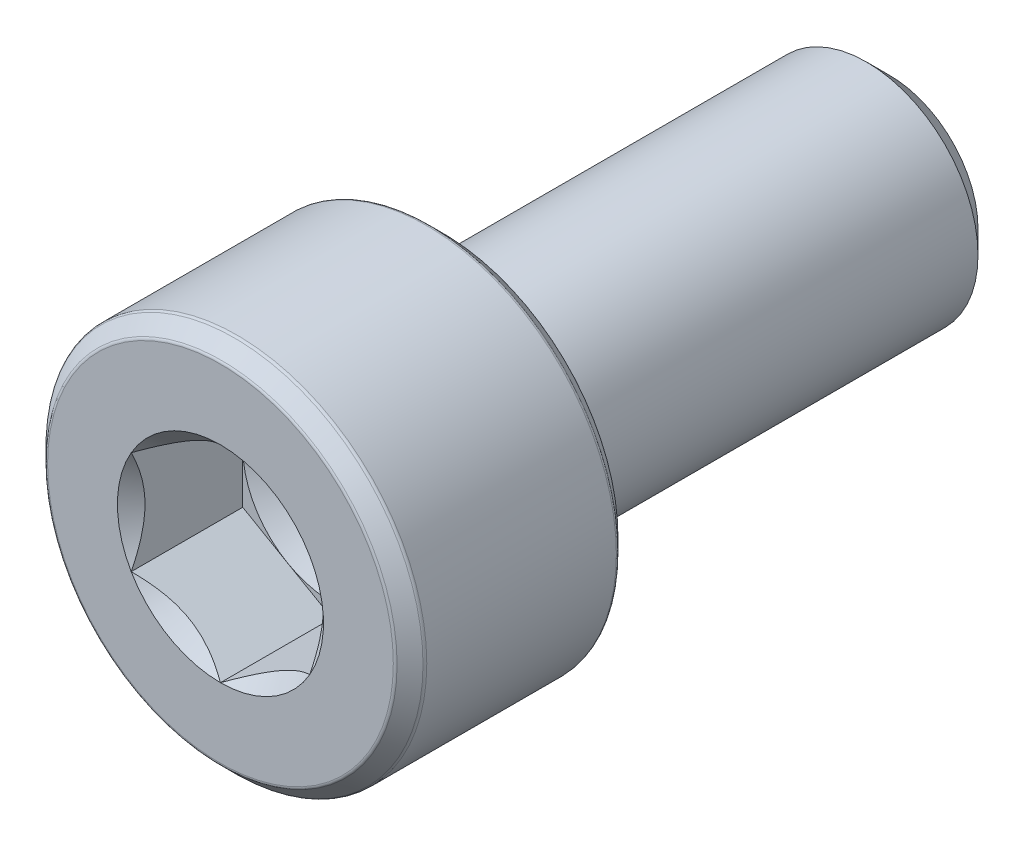
ISO-10303-21;
HEADER;
FILE_DESCRIPTION(('STEP AP214'),'2;1');
FILE_NAME('part.step','',(''),(''),'','','');
FILE_SCHEMA(('AUTOMOTIVE_DESIGN { 1 0 10303 214 1 1 1 1 }'));
ENDSEC;
DATA;
#1=APPLICATION_CONTEXT('core data for automotive mechanical design processes');
#2=APPLICATION_PROTOCOL_DEFINITION('international standard','automotive_design',2000,#1);
#3=PRODUCT_CONTEXT('',#1,'mechanical');
#4=PRODUCT('Part','Part','',(#3));
#5=PRODUCT_RELATED_PRODUCT_CATEGORY('part','',(#4));
#6=PRODUCT_DEFINITION_FORMATION('','',#4);
#7=PRODUCT_DEFINITION_CONTEXT('part definition',#1,'design');
#8=PRODUCT_DEFINITION('design','',#6,#7);
#9=PRODUCT_DEFINITION_SHAPE('','',#8);
#10=(LENGTH_UNIT() NAMED_UNIT(*) SI_UNIT(.MILLI.,.METRE.));
#11=(NAMED_UNIT(*) PLANE_ANGLE_UNIT() SI_UNIT($,.RADIAN.));
#12=(NAMED_UNIT(*) SI_UNIT($,.STERADIAN.) SOLID_ANGLE_UNIT());
#13=UNCERTAINTY_MEASURE_WITH_UNIT(LENGTH_MEASURE(1.E-05),#10,'distance_accuracy_value','');
#14=(GEOMETRIC_REPRESENTATION_CONTEXT(3) GLOBAL_UNCERTAINTY_ASSIGNED_CONTEXT((#13)) GLOBAL_UNIT_ASSIGNED_CONTEXT((#10,
#11,#12)) REPRESENTATION_CONTEXT('',''));
#15=CARTESIAN_POINT('',(0.,0.,0.));
#16=DIRECTION('',(0.,0.,1.));
#17=DIRECTION('',(1.,0.,0.));
#18=AXIS2_PLACEMENT_3D('',#15,#16,#17);
#19=CARTESIAN_POINT('',(0.,2.,5.));
#20=DIRECTION('',(0.,0.,-1.));
#21=DIRECTION('',(-1.,0.,0.));
#22=AXIS2_PLACEMENT_3D('',#19,#20,#21);
#23=PLANE('',#22);
#24=DIRECTION('',(0.,-1.,0.));
#25=VECTOR('',#24,1.);
#26=CARTESIAN_POINT('',(-2.,1.15470053837925,5.));
#27=LINE('',#26,#25);
#28=CARTESIAN_POINT('',(-2.,1.15470053837925,5.));
#29=VERTEX_POINT('',#28);
#30=CARTESIAN_POINT('',(-2.,0.,5.));
#31=VERTEX_POINT('',#30);
#32=EDGE_CURVE('E142',#29,#31,#27,.T.);
#33=ORIENTED_EDGE('',*,*,#32,.T.);
#34=CARTESIAN_POINT('',(0.,0.,5.));
#35=DIRECTION('',(0.,0.,-1.));
#36=DIRECTION('',(-1.,0.,0.));
#37=AXIS2_PLACEMENT_3D('',#34,#35,#36);
#38=CIRCLE('',#37,2.);
#39=CARTESIAN_POINT('',(-1.,1.73205080756888,5.));
#40=VERTEX_POINT('',#39);
#41=EDGE_CURVE('E11',#31,#40,#38,.T.);
#42=ORIENTED_EDGE('',*,*,#41,.T.);
#43=DIRECTION('',(-0.866025403784439,-0.5,0.));
#44=VECTOR('',#43,1.);
#45=CARTESIAN_POINT('',(0.,2.3094010767585,5.));
#46=LINE('',#45,#44);
#47=EDGE_CURVE('E135',#40,#29,#46,.T.);
#48=ORIENTED_EDGE('',*,*,#47,.T.);
#49=EDGE_LOOP('',(#33,#42,#48));
#50=FACE_BOUND('',#49,.T.);
#51=ADVANCED_FACE('F33',(#50),#23,.F.);
#52=CARTESIAN_POINT('',(0.,2.3094010767585,5.));
#53=VERTEX_POINT('',#52);
#54=EDGE_CURVE('E122',#53,#40,#46,.T.);
#55=ORIENTED_EDGE('',*,*,#54,.T.);
#56=CARTESIAN_POINT('',(0.999999999999999,1.73205080756888,5.));
#57=VERTEX_POINT('',#56);
#58=EDGE_CURVE('E42',#40,#57,#38,.T.);
#59=ORIENTED_EDGE('',*,*,#58,.T.);
#60=DIRECTION('',(-0.866025403784439,0.5,0.));
#61=VECTOR('',#60,1.);
#62=CARTESIAN_POINT('',(2.,1.15470053837925,5.));
#63=LINE('',#62,#61);
#64=EDGE_CURVE('E120',#57,#53,#63,.T.);
#65=ORIENTED_EDGE('',*,*,#64,.T.);
#66=EDGE_LOOP('',(#55,#59,#65));
#67=FACE_BOUND('',#66,.T.);
#68=ADVANCED_FACE('F119',(#67),#23,.F.);
#69=CARTESIAN_POINT('',(2.,1.15470053837925,5.));
#70=VERTEX_POINT('',#69);
#71=EDGE_CURVE('E127',#70,#57,#63,.T.);
#72=ORIENTED_EDGE('',*,*,#71,.T.);
#73=CARTESIAN_POINT('',(0.,0.,5.));
#74=DIRECTION('',(0.,0.,1.));
#75=DIRECTION('',(1.,0.,0.));
#76=AXIS2_PLACEMENT_3D('',#73,#74,#75);
#77=CIRCLE('',#76,2.);
#78=CARTESIAN_POINT('',(2.,0.,5.));
#79=VERTEX_POINT('',#78);
#80=EDGE_CURVE('E110',#79,#57,#77,.T.);
#81=ORIENTED_EDGE('',*,*,#80,.F.);
#82=DIRECTION('',(0.,1.,0.));
#83=VECTOR('',#82,1.);
#84=CARTESIAN_POINT('',(2.,-1.15470053837925,5.));
#85=LINE('',#84,#83);
#86=EDGE_CURVE('E55',#79,#70,#85,.T.);
#87=ORIENTED_EDGE('',*,*,#86,.T.);
#88=EDGE_LOOP('',(#72,#81,#87));
#89=FACE_BOUND('',#88,.T.);
#90=ADVANCED_FACE('F134',(#89),#23,.F.);
#91=CARTESIAN_POINT('',(2.,-1.15470053837925,5.));
#92=VERTEX_POINT('',#91);
#93=EDGE_CURVE('E153',#92,#79,#85,.T.);
#94=ORIENTED_EDGE('',*,*,#93,.T.);
#95=CARTESIAN_POINT('',(0.999999999999999,-1.73205080756887,5.));
#96=VERTEX_POINT('',#95);
#97=EDGE_CURVE('E113',#79,#96,#38,.T.);
#98=ORIENTED_EDGE('',*,*,#97,.T.);
#99=DIRECTION('',(0.866025403784439,0.5,0.));
#100=VECTOR('',#99,1.);
#101=CARTESIAN_POINT('',(0.,-2.3094010767585,5.));
#102=LINE('',#101,#100);
#103=EDGE_CURVE('E149',#96,#92,#102,.T.);
#104=ORIENTED_EDGE('',*,*,#103,.T.);
#105=EDGE_LOOP('',(#94,#98,#104));
#106=FACE_BOUND('',#105,.T.);
#107=ADVANCED_FACE('F212',(#106),#23,.F.);
#108=CARTESIAN_POINT('',(0.,-2.3094010767585,5.));
#109=VERTEX_POINT('',#108);
#110=EDGE_CURVE('E150',#109,#96,#102,.T.);
#111=ORIENTED_EDGE('',*,*,#110,.T.);
#112=CARTESIAN_POINT('',(-1.,-1.73205080756887,5.));
#113=VERTEX_POINT('',#112);
#114=EDGE_CURVE('E204',#96,#113,#38,.T.);
#115=ORIENTED_EDGE('',*,*,#114,.T.);
#116=DIRECTION('',(0.866025403784439,-0.5,0.));
#117=VECTOR('',#116,1.);
#118=CARTESIAN_POINT('',(-2.,-1.15470053837925,5.));
#119=LINE('',#118,#117);
#120=EDGE_CURVE('E145',#113,#109,#119,.T.);
#121=ORIENTED_EDGE('',*,*,#120,.T.);
#122=EDGE_LOOP('',(#111,#115,#121));
#123=FACE_BOUND('',#122,.T.);
#124=ADVANCED_FACE('F220',(#123),#23,.F.);
#125=CARTESIAN_POINT('',(0.,3.87479184719829,7.5));
#126=DIRECTION('',(0.,0.,-1.));
#127=DIRECTION('',(-1.,0.,0.));
#128=AXIS2_PLACEMENT_3D('',#125,#126,#127);
#129=PLANE('',#128);
#130=CARTESIAN_POINT('',(0.,0.,7.5));
#131=DIRECTION('',(0.,0.,1.));
#132=DIRECTION('',(1.,0.,0.));
#133=AXIS2_PLACEMENT_3D('',#130,#131,#132);
#134=CIRCLE('',#133,2.3094010767585);
#135=CARTESIAN_POINT('',(0.,2.3094010767585,7.5));
#136=VERTEX_POINT('',#135);
#137=CARTESIAN_POINT('',(-2.,1.15470053837925,7.5));
#138=VERTEX_POINT('',#137);
#139=EDGE_CURVE('E251',#136,#138,#134,.T.);
#140=ORIENTED_EDGE('',*,*,#139,.F.);
#141=CARTESIAN_POINT('',(0.,0.,7.5));
#142=DIRECTION('',(0.,0.,1.));
#143=DIRECTION('',(1.,0.,0.));
#144=AXIS2_PLACEMENT_3D('',#141,#142,#143);
#145=CIRCLE('',#144,2.3094010767585);
#146=CARTESIAN_POINT('',(2.,1.15470053837925,7.5));
#147=VERTEX_POINT('',#146);
#148=EDGE_CURVE('E114',#147,#136,#145,.T.);
#149=ORIENTED_EDGE('',*,*,#148,.F.);
#150=CARTESIAN_POINT('',(0.,0.,7.5));
#151=DIRECTION('',(0.,0.,1.));
#152=DIRECTION('',(1.,0.,0.));
#153=AXIS2_PLACEMENT_3D('',#150,#151,#152);
#154=CIRCLE('',#153,2.3094010767585);
#155=CARTESIAN_POINT('',(2.,-1.15470053837925,7.5));
#156=VERTEX_POINT('',#155);
#157=EDGE_CURVE('E132',#156,#147,#154,.T.);
#158=ORIENTED_EDGE('',*,*,#157,.F.);
#159=CARTESIAN_POINT('',(0.,0.,7.5));
#160=DIRECTION('',(0.,0.,1.));
#161=DIRECTION('',(1.,0.,0.));
#162=AXIS2_PLACEMENT_3D('',#159,#160,#161);
#163=CIRCLE('',#162,2.3094010767585);
#164=CARTESIAN_POINT('',(0.,-2.3094010767585,7.5));
#165=VERTEX_POINT('',#164);
#166=EDGE_CURVE('E257',#165,#156,#163,.T.);
#167=ORIENTED_EDGE('',*,*,#166,.F.);
#168=CARTESIAN_POINT('',(0.,0.,7.5));
#169=DIRECTION('',(0.,0.,1.));
#170=DIRECTION('',(1.,0.,0.));
#171=AXIS2_PLACEMENT_3D('',#168,#169,#170);
#172=CIRCLE('',#171,2.3094010767585);
#173=CARTESIAN_POINT('',(-2.,-1.15470053837925,7.5));
#174=VERTEX_POINT('',#173);
#175=EDGE_CURVE('E138',#174,#165,#172,.T.);
#176=ORIENTED_EDGE('',*,*,#175,.F.);
#177=CARTESIAN_POINT('',(0.,0.,7.5));
#178=DIRECTION('',(0.,0.,1.));
#179=DIRECTION('',(1.,0.,0.));
#180=AXIS2_PLACEMENT_3D('',#177,#178,#179);
#181=CIRCLE('',#180,2.3094010767585);
#182=EDGE_CURVE('E243',#138,#174,#181,.T.);
#183=ORIENTED_EDGE('',*,*,#182,.F.);
#184=EDGE_LOOP('',(#140,#149,#158,#167,#176,#183));
#185=FACE_BOUND('',#184,.T.);
#186=CARTESIAN_POINT('',(0.,0.,7.5));
#187=DIRECTION('',(0.,0.,1.));
#188=DIRECTION('',(1.,0.,0.));
#189=AXIS2_PLACEMENT_3D('',#186,#187,#188);
#190=CIRCLE('',#189,3.87479184719829);
#191=CARTESIAN_POINT('',(3.87479184719829,0.,7.5));
#192=VERTEX_POINT('',#191);
#193=EDGE_CURVE('E200',#192,#192,#190,.T.);
#194=ORIENTED_EDGE('',*,*,#193,.T.);
#195=EDGE_LOOP('',(#194));
#196=FACE_BOUND('',#195,.T.);
#197=ADVANCED_FACE('F35',(#185,#196),#129,.F.);
#198=CARTESIAN_POINT('',(0.,0.,7.415));
#199=DIRECTION('',(0.,0.,1.));
#200=DIRECTION('',(1.,0.,0.));
#201=AXIS2_PLACEMENT_3D('',#198,#199,#200);
#202=TOROIDAL_SURFACE('',#201,3.87479184719829,0.0850000000000001);
#203=ORIENTED_EDGE('',*,*,#193,.F.);
#204=EDGE_LOOP('',(#203));
#205=FACE_BOUND('',#204,.T.);
#206=CARTESIAN_POINT('',(0.,0.,7.47510407640085));
#207=DIRECTION('',(0.,0.,1.));
#208=DIRECTION('',(1.,0.,0.));
#209=AXIS2_PLACEMENT_3D('',#206,#207,#208);
#210=CIRCLE('',#209,3.93489592359915);
#211=CARTESIAN_POINT('',(3.93489592359915,0.,7.47510407640085));
#212=VERTEX_POINT('',#211);
#213=EDGE_CURVE('E198',#212,#212,#210,.T.);
#214=ORIENTED_EDGE('',*,*,#213,.T.);
#215=EDGE_LOOP('',(#214));
#216=FACE_BOUND('',#215,.T.);
#217=ADVANCED_FACE('F344',(#205,#216),#202,.T.);
#218=CARTESIAN_POINT('',(0.,0.,7.18489592359915));
#219=DIRECTION('',(0.,0.,-1.));
#220=DIRECTION('',(-1.,0.,0.));
#221=AXIS2_PLACEMENT_3D('',#218,#219,#220);
#222=CONICAL_SURFACE('',#221,4.22510407640086,0.785398163397453);
#223=ORIENTED_EDGE('',*,*,#213,.F.);
#224=EDGE_LOOP('',(#223));
#225=FACE_BOUND('',#224,.T.);
#226=CARTESIAN_POINT('',(0.,0.,7.18489592359915));
#227=DIRECTION('',(0.,0.,1.));
#228=DIRECTION('',(1.,0.,0.));
#229=AXIS2_PLACEMENT_3D('',#226,#227,#228);
#230=CIRCLE('',#229,4.22510407640086);
#231=CARTESIAN_POINT('',(4.22510407640086,0.,7.18489592359915));
#232=VERTEX_POINT('',#231);
#233=EDGE_CURVE('E195',#232,#232,#230,.T.);
#234=ORIENTED_EDGE('',*,*,#233,.T.);
#235=EDGE_LOOP('',(#234));
#236=FACE_BOUND('',#235,.T.);
#237=ADVANCED_FACE('F341',(#225,#236),#222,.T.);
#238=CARTESIAN_POINT('',(0.,0.,7.12479184719829));
#239=DIRECTION('',(0.,0.,1.));
#240=DIRECTION('',(1.,0.,0.));
#241=AXIS2_PLACEMENT_3D('',#238,#239,#240);
#242=TOROIDAL_SURFACE('',#241,4.165,0.0850000000000002);
#243=ORIENTED_EDGE('',*,*,#233,.F.);
#244=EDGE_LOOP('',(#243));
#245=FACE_BOUND('',#244,.T.);
#246=CARTESIAN_POINT('',(0.,0.,7.12479184719829));
#247=DIRECTION('',(0.,0.,1.));
#248=DIRECTION('',(1.,0.,0.));
#249=AXIS2_PLACEMENT_3D('',#246,#247,#248);
#250=CIRCLE('',#249,4.25);
#251=CARTESIAN_POINT('',(4.25,0.,7.12479184719829));
#252=VERTEX_POINT('',#251);
#253=EDGE_CURVE('E192',#252,#252,#250,.T.);
#254=ORIENTED_EDGE('',*,*,#253,.T.);
#255=EDGE_LOOP('',(#254));
#256=FACE_BOUND('',#255,.T.);
#257=ADVANCED_FACE('F337',(#245,#256),#242,.T.);
#258=CARTESIAN_POINT('',(0.,0.,7.5));
#259=DIRECTION('',(0.,0.,1.));
#260=DIRECTION('',(1.,0.,0.));
#261=AXIS2_PLACEMENT_3D('',#258,#259,#260);
#262=CYLINDRICAL_SURFACE('',#261,4.25);
#263=ORIENTED_EDGE('',*,*,#253,.F.);
#264=EDGE_LOOP('',(#263));
#265=FACE_BOUND('',#264,.T.);
#266=CARTESIAN_POINT('',(0.,0.,2.87520815280171));
#267=DIRECTION('',(0.,0.,1.));
#268=DIRECTION('',(1.,0.,0.));
#269=AXIS2_PLACEMENT_3D('',#266,#267,#268);
#270=CIRCLE('',#269,4.25);
#271=CARTESIAN_POINT('',(4.25,0.,2.87520815280171));
#272=VERTEX_POINT('',#271);
#273=EDGE_CURVE('E189',#272,#272,#270,.T.);
#274=ORIENTED_EDGE('',*,*,#273,.T.);
#275=EDGE_LOOP('',(#274));
#276=FACE_BOUND('',#275,.T.);
#277=ADVANCED_FACE('F333',(#265,#276),#262,.T.);
#278=CARTESIAN_POINT('',(0.,0.,2.87520815280171));
#279=DIRECTION('',(0.,0.,1.));
#280=DIRECTION('',(1.,0.,0.));
#281=AXIS2_PLACEMENT_3D('',#278,#279,#280);
#282=TOROIDAL_SURFACE('',#281,4.165,0.0849999999999999);
#283=ORIENTED_EDGE('',*,*,#273,.F.);
#284=EDGE_LOOP('',(#283));
#285=FACE_BOUND('',#284,.T.);
#286=CARTESIAN_POINT('',(0.,0.,2.81510407640085));
#287=DIRECTION('',(0.,0.,1.));
#288=DIRECTION('',(1.,0.,0.));
#289=AXIS2_PLACEMENT_3D('',#286,#287,#288);
#290=CIRCLE('',#289,4.22510407640086);
#291=CARTESIAN_POINT('',(4.22510407640086,0.,2.81510407640085));
#292=VERTEX_POINT('',#291);
#293=EDGE_CURVE('E186',#292,#292,#290,.T.);
#294=ORIENTED_EDGE('',*,*,#293,.T.);
#295=EDGE_LOOP('',(#294));
#296=FACE_BOUND('',#295,.T.);
#297=ADVANCED_FACE('F329',(#285,#296),#282,.T.);
#298=CARTESIAN_POINT('',(0.,0.,2.52489592359914));
#299=DIRECTION('',(0.,0.,1.));
#300=DIRECTION('',(1.,0.,0.));
#301=AXIS2_PLACEMENT_3D('',#298,#299,#300);
#302=CONICAL_SURFACE('',#301,3.93489592359915,0.785398163397447);
#303=ORIENTED_EDGE('',*,*,#293,.F.);
#304=EDGE_LOOP('',(#303));
#305=FACE_BOUND('',#304,.T.);
#306=CARTESIAN_POINT('',(0.,0.,2.52489592359914));
#307=DIRECTION('',(0.,0.,1.));
#308=DIRECTION('',(1.,0.,0.));
#309=AXIS2_PLACEMENT_3D('',#306,#307,#308);
#310=CIRCLE('',#309,3.93489592359915);
#311=CARTESIAN_POINT('',(3.93489592359915,0.,2.52489592359914));
#312=VERTEX_POINT('',#311);
#313=EDGE_CURVE('E183',#312,#312,#310,.T.);
#314=ORIENTED_EDGE('',*,*,#313,.T.);
#315=EDGE_LOOP('',(#314));
#316=FACE_BOUND('',#315,.T.);
#317=ADVANCED_FACE('F325',(#305,#316),#302,.T.);
#318=CARTESIAN_POINT('',(0.,0.,2.585));
#319=DIRECTION('',(0.,0.,1.));
#320=DIRECTION('',(1.,0.,0.));
#321=AXIS2_PLACEMENT_3D('',#318,#319,#320);
#322=TOROIDAL_SURFACE('',#321,3.87479184719829,0.0849999999999998);
#323=ORIENTED_EDGE('',*,*,#313,.F.);
#324=EDGE_LOOP('',(#323));
#325=FACE_BOUND('',#324,.T.);
#326=CARTESIAN_POINT('',(0.,0.,2.5));
#327=DIRECTION('',(0.,0.,1.));
#328=DIRECTION('',(1.,0.,0.));
#329=AXIS2_PLACEMENT_3D('',#326,#327,#328);
#330=CIRCLE('',#329,3.87479184719829);
#331=CARTESIAN_POINT('',(3.87479184719829,0.,2.5));
#332=VERTEX_POINT('',#331);
#333=EDGE_CURVE('E180',#332,#332,#330,.T.);
#334=ORIENTED_EDGE('',*,*,#333,.T.);
#335=EDGE_LOOP('',(#334));
#336=FACE_BOUND('',#335,.T.);
#337=ADVANCED_FACE('F321',(#325,#336),#322,.T.);
#338=CARTESIAN_POINT('',(0.,2.5,2.5));
#339=DIRECTION('',(0.,0.,1.));
#340=DIRECTION('',(1.,0.,0.));
#341=AXIS2_PLACEMENT_3D('',#338,#339,#340);
#342=PLANE('',#341);
#343=ORIENTED_EDGE('',*,*,#333,.F.);
#344=EDGE_LOOP('',(#343));
#345=FACE_BOUND('',#344,.T.);
#346=CARTESIAN_POINT('',(0.,0.,2.5));
#347=DIRECTION('',(0.,0.,1.));
#348=DIRECTION('',(1.,0.,0.));
#349=AXIS2_PLACEMENT_3D('',#346,#347,#348);
#350=CIRCLE('',#349,2.5);
#351=CARTESIAN_POINT('',(2.5,0.,2.5));
#352=VERTEX_POINT('',#351);
#353=EDGE_CURVE('E177',#352,#352,#350,.T.);
#354=ORIENTED_EDGE('',*,*,#353,.T.);
#355=EDGE_LOOP('',(#354));
#356=FACE_BOUND('',#355,.T.);
#357=ADVANCED_FACE('F317',(#345,#356),#342,.F.);
#358=CARTESIAN_POINT('',(0.,0.,7.5));
#359=DIRECTION('',(0.,0.,1.));
#360=DIRECTION('',(1.,0.,0.));
#361=AXIS2_PLACEMENT_3D('',#358,#359,#360);
#362=CYLINDRICAL_SURFACE('',#361,2.5);
#363=ORIENTED_EDGE('',*,*,#353,.F.);
#364=EDGE_LOOP('',(#363));
#365=FACE_BOUND('',#364,.T.);
#366=CARTESIAN_POINT('',(0.,0.,-6.98038475772934));
#367=DIRECTION('',(0.,0.,1.));
#368=DIRECTION('',(1.,0.,0.));
#369=AXIS2_PLACEMENT_3D('',#366,#367,#368);
#370=CIRCLE('',#369,2.5);
#371=CARTESIAN_POINT('',(2.5,0.,-6.98038475772934));
#372=VERTEX_POINT('',#371);
#373=EDGE_CURVE('E174',#372,#372,#370,.T.);
#374=ORIENTED_EDGE('',*,*,#373,.T.);
#375=EDGE_LOOP('',(#374));
#376=FACE_BOUND('',#375,.T.);
#377=ADVANCED_FACE('F313',(#365,#376),#362,.T.);
#378=CARTESIAN_POINT('',(0.,0.,-7.5));
#379=DIRECTION('',(0.,0.,1.));
#380=DIRECTION('',(1.,0.,0.));
#381=AXIS2_PLACEMENT_3D('',#378,#379,#380);
#382=CONICAL_SURFACE('',#381,1.98038475772933,0.78539816339745);
#383=ORIENTED_EDGE('',*,*,#373,.F.);
#384=EDGE_LOOP('',(#383));
#385=FACE_BOUND('',#384,.T.);
#386=CARTESIAN_POINT('',(0.,0.,-7.5));
#387=DIRECTION('',(0.,0.,1.));
#388=DIRECTION('',(1.,0.,0.));
#389=AXIS2_PLACEMENT_3D('',#386,#387,#388);
#390=CIRCLE('',#389,1.98038475772933);
#391=CARTESIAN_POINT('',(1.98038475772933,0.,-7.5));
#392=VERTEX_POINT('',#391);
#393=EDGE_CURVE('E158',#392,#392,#390,.T.);
#394=ORIENTED_EDGE('',*,*,#393,.T.);
#395=EDGE_LOOP('',(#394));
#396=FACE_BOUND('',#395,.T.);
#397=ADVANCED_FACE('F309',(#385,#396),#382,.T.);
#398=CARTESIAN_POINT('',(0.,0.,-7.5));
#399=DIRECTION('',(0.,0.,1.));
#400=DIRECTION('',(1.,0.,0.));
#401=AXIS2_PLACEMENT_3D('',#398,#399,#400);
#402=PLANE('',#401);
#403=ORIENTED_EDGE('',*,*,#393,.F.);
#404=EDGE_LOOP('',(#403));
#405=FACE_BOUND('',#404,.T.);
#406=ADVANCED_FACE('F304',(#405),#402,.F.);
#407=CARTESIAN_POINT('',(2.,1.15470053837925,5.));
#408=DIRECTION('',(0.5,0.866025403784439,0.));
#409=DIRECTION('',(-0.866025403784439,0.5,0.));
#410=AXIS2_PLACEMENT_3D('',#407,#408,#409);
#411=PLANE('',#410);
#412=DIRECTION('',(0.,0.,1.));
#413=VECTOR('',#412,1.);
#414=CARTESIAN_POINT('',(2.,1.15470053837925,5.));
#415=LINE('',#414,#413);
#416=EDGE_CURVE('E156',#70,#147,#415,.T.);
#417=ORIENTED_EDGE('',*,*,#416,.T.);
#418=CARTESIAN_POINT('',(-0.000199999999999977,2.30951654681234,7.50011547871366));
#419=CARTESIAN_POINT('',(0.0685530340307055,2.26982196410711,7.46045309022559));
#420=CARTESIAN_POINT('',(0.138455742135512,2.22946361676572,7.42311998228416));
#421=CARTESIAN_POINT('',(0.280995244550437,2.1471683966763,7.35476368513614));
#422=CARTESIAN_POINT('',(0.353645597565359,2.10522369580642,7.32377853373722));
#423=CARTESIAN_POINT('',(0.500141601053972,2.02064418875706,7.27070021654414));
#424=CARTESIAN_POINT('',(0.573949935246295,1.97803092714269,7.24847362717661));
#425=CARTESIAN_POINT('',(0.723191631835265,1.89186619344273,7.21422881667508));
#426=CARTESIAN_POINT('',(0.798620433918153,1.84831735425552,7.20218502914413));
#427=CARTESIAN_POINT('',(0.92861550067108,1.7732646674724,7.19131851190557));
#428=CARTESIAN_POINT('',(0.98301378397011,1.74185780396625,7.18970975360997));
#429=CARTESIAN_POINT('',(1.09172145551969,1.67909540053412,7.19241887759871));
#430=CARTESIAN_POINT('',(1.14603080592134,1.64773988246021,7.19673883775797));
#431=CARTESIAN_POINT('',(1.25413672758934,1.5853248994842,7.21105956740991));
#432=CARTESIAN_POINT('',(1.30793265655479,1.55426580541469,7.22106669276201));
#433=CARTESIAN_POINT('',(1.41459426230557,1.49268469862228,7.24621243024966));
#434=CARTESIAN_POINT('',(1.46746001007071,1.46216264491917,7.26135064904224));
#435=CARTESIAN_POINT('',(1.60287973308985,1.38397803138049,7.30629450342919));
#436=CARTESIAN_POINT('',(1.68459383484948,1.33680037273297,7.33948883942582));
#437=CARTESIAN_POINT('',(1.8047470372578,1.26742988897853,7.39552582317137));
#438=CARTESIAN_POINT('',(1.84434285210918,1.24456923461531,7.41521470294694));
#439=CARTESIAN_POINT('',(1.92280095888787,1.19927142554652,7.45638731836487));
#440=CARTESIAN_POINT('',(1.96166368359374,1.17683402097614,7.47786995165125));
#441=CARTESIAN_POINT('',(2.0002,1.15458506832541,7.50011547871366));
#442=B_SPLINE_CURVE_WITH_KNOTS('',3,(#418,#419,#420,#421,#422,#423,#424,#425,#426,#427,#428,
#429,#430,#431,#432,#433,#434,#435,#436,#437,#438,#439,#440,#441),.UNSPECIFIED.,.F.,.F.,(4,2,2,
2,2,2,2,2,2,2,2,4),(0.,0.266420613771064,0.53439375152339,0.798110374376916,1.06116288956937,
1.24939906803722,1.43770123566248,1.62621426093932,1.81471283831913,2.11415604834145,
2.2634717071779,2.41269626969771),.UNSPECIFIED.);
#443=EDGE_CURVE('E244',#136,#147,#442,.T.);
#444=ORIENTED_EDGE('',*,*,#443,.F.);
#445=DIRECTION('',(0.,0.,1.));
#446=VECTOR('',#445,1.);
#447=CARTESIAN_POINT('',(0.,2.3094010767585,5.));
#448=LINE('',#447,#446);
#449=EDGE_CURVE('E131',#53,#136,#448,.T.);
#450=ORIENTED_EDGE('',*,*,#449,.F.);
#451=ORIENTED_EDGE('',*,*,#64,.F.);
#452=ORIENTED_EDGE('',*,*,#71,.F.);
#453=EDGE_LOOP('',(#417,#444,#450,#451,#452));
#454=FACE_BOUND('',#453,.T.);
#455=ADVANCED_FACE('F126',(#454),#411,.F.);
#456=CARTESIAN_POINT('',(2.,-1.15470053837925,5.));
#457=DIRECTION('',(1.,0.,0.));
#458=DIRECTION('',(0.,1.,0.));
#459=AXIS2_PLACEMENT_3D('',#456,#457,#458);
#460=PLANE('',#459);
#461=DIRECTION('',(0.,0.,1.));
#462=VECTOR('',#461,1.);
#463=CARTESIAN_POINT('',(2.,-1.15470053837925,5.));
#464=LINE('',#463,#462);
#465=EDGE_CURVE('E159',#92,#156,#464,.T.);
#466=ORIENTED_EDGE('',*,*,#465,.T.);
#467=CARTESIAN_POINT('',(2.,-2.30294417292923,8.24077135502772));
#468=CARTESIAN_POINT('',(2.,-2.24687002663712,8.19844327362596));
#469=CARTESIAN_POINT('',(2.,-2.19048190536959,8.15652515686433));
#470=CARTESIAN_POINT('',(2.,-2.07695390496424,8.07369041786101));
#471=CARTESIAN_POINT('',(2.,-2.01981384066454,8.03277404966807));
#472=CARTESIAN_POINT('',(2.,-1.90424016804775,7.95183345201856));
#473=CARTESIAN_POINT('',(2.,-1.8457999674391,7.91181859155986));
#474=CARTESIAN_POINT('',(2.,-1.7279274546176,7.83328899366429));
#475=CARTESIAN_POINT('',(2.,-1.66849521292324,7.79477415024314));
#476=CARTESIAN_POINT('',(2.,-1.4816299571002,7.67764065160429));
#477=CARTESIAN_POINT('',(2.,-1.35220318163536,7.60214590172964));
#478=CARTESIAN_POINT('',(2.,-1.08689521592924,7.46404935099438));
#479=CARTESIAN_POINT('',(2.,-0.951037763938191,7.40140408590349));
#480=CARTESIAN_POINT('',(2.,-0.747111912259408,7.32476354387514));
#481=CARTESIAN_POINT('',(2.,-0.682064034147875,7.30276717991912));
#482=CARTESIAN_POINT('',(2.,-0.550398103294752,7.26399668766014));
#483=CARTESIAN_POINT('',(2.,-0.483779942722475,7.24722291912118));
#484=CARTESIAN_POINT('',(2.,-0.350484328847654,7.22004825788444));
#485=CARTESIAN_POINT('',(2.,-0.283829489364785,7.20953817674169));
#486=CARTESIAN_POINT('',(2.,-0.149806987139377,7.19509608554491));
#487=CARTESIAN_POINT('',(2.,-0.082439448934122,7.19116294473311));
#488=CARTESIAN_POINT('',(2.,0.0499055622944893,7.19016647693372));
#489=CARTESIAN_POINT('',(2.,0.114881285143172,7.19285964485041));
#490=CARTESIAN_POINT('',(2.,0.24427592148276,7.20443007042269));
#491=CARTESIAN_POINT('',(2.,0.308694780266753,7.21330792883322));
#492=CARTESIAN_POINT('',(2.,0.437599788610704,7.23691365929615));
#493=CARTESIAN_POINT('',(2.,0.502067428644594,7.25174108344651));
#494=CARTESIAN_POINT('',(2.,0.629594322598305,7.28645788362797));
#495=CARTESIAN_POINT('',(2.,0.692653693883149,7.30634683610627));
#496=CARTESIAN_POINT('',(2.,0.891187889210543,7.3764469792562));
#497=CARTESIAN_POINT('',(2.,1.02383545707306,7.43464180032151));
#498=CARTESIAN_POINT('',(2.,1.28290932150074,7.56403057545957));
#499=CARTESIAN_POINT('',(2.,1.4093111258757,7.63527123141484));
#500=CARTESIAN_POINT('',(2.,1.59200441438963,7.74644199187472));
#501=CARTESIAN_POINT('',(2.,1.6502754902619,7.78318219033737));
#502=CARTESIAN_POINT('',(2.,1.76581760389242,7.85821451418376));
#503=CARTESIAN_POINT('',(2.,1.82308856543104,7.89650675711804));
#504=CARTESIAN_POINT('',(2.,1.93629654762084,7.97404226408122));
#505=CARTESIAN_POINT('',(2.,1.99224062500538,8.01327527613358));
#506=CARTESIAN_POINT('',(2.,2.10336424029899,8.09277883073651));
#507=CARTESIAN_POINT('',(2.,2.15854398422468,8.13304908500059));
#508=CARTESIAN_POINT('',(2.,2.21340370692658,8.17374423814594));
#509=B_SPLINE_CURVE_WITH_KNOTS('',3,(#467,#468,#469,#470,#471,#472,#473,#474,#475,#476,#477,
#478,#479,#480,#481,#482,#483,#484,#485,#486,#487,#488,#489,#490,#491,#492,#493,#494,#495,#496,
#497,#498,#499,#500,#501,#502,#503,#504,#505,#506,#507,#508),.UNSPECIFIED.,.F.,.F.,(4,2,2,2,2,2,
2,2,2,2,2,2,2,2,2,2,2,2,2,2,4),(0.,0.210772731976891,0.421598374658589,0.634057554623487,
0.846501695870169,1.29562155455624,1.74319622821645,1.94902062110207,2.15485918928325,
2.35699582502635,2.5590977043214,2.75388435553556,2.94868993014814,3.14690093452585,
3.34509535789701,3.77838155837653,4.21325029921624,4.41989056685646,4.6265465146092,
4.83152377111289,5.03644465914084),.UNSPECIFIED.);
#510=EDGE_CURVE('E258',#147,#156,#509,.F.);
#511=ORIENTED_EDGE('',*,*,#510,.F.);
#512=ORIENTED_EDGE('',*,*,#416,.F.);
#513=ORIENTED_EDGE('',*,*,#86,.F.);
#514=ORIENTED_EDGE('',*,*,#93,.F.);
#515=EDGE_LOOP('',(#466,#511,#512,#513,#514));
#516=FACE_BOUND('',#515,.T.);
#517=ADVANCED_FACE('F290',(#516),#460,.F.);
#518=CARTESIAN_POINT('',(0.,-2.3094010767585,5.));
#519=DIRECTION('',(0.5,-0.866025403784439,0.));
#520=DIRECTION('',(0.866025403784439,0.5,0.));
#521=AXIS2_PLACEMENT_3D('',#518,#519,#520);
#522=PLANE('',#521);
#523=DIRECTION('',(0.,0.,1.));
#524=VECTOR('',#523,1.);
#525=CARTESIAN_POINT('',(0.,-2.3094010767585,5.));
#526=LINE('',#525,#524);
#527=EDGE_CURVE('E162',#109,#165,#526,.T.);
#528=ORIENTED_EDGE('',*,*,#527,.T.);
#529=CARTESIAN_POINT('',(2.0002,-1.15458506832541,7.50011547871366));
#530=CARTESIAN_POINT('',(1.93144696596929,-1.19427965103064,7.46045309022559));
#531=CARTESIAN_POINT('',(1.86154425786449,-1.23463799837204,7.42311998228416));
#532=CARTESIAN_POINT('',(1.71900475544956,-1.31693321846145,7.35476368513614));
#533=CARTESIAN_POINT('',(1.64635440243464,-1.35887791933134,7.32377853373722));
#534=CARTESIAN_POINT('',(1.49985839894603,-1.44345742638069,7.27070021654414));
#535=CARTESIAN_POINT('',(1.4260500647537,-1.48607068799507,7.24847362717661));
#536=CARTESIAN_POINT('',(1.27680836816473,-1.57223542169503,7.21422881667508));
#537=CARTESIAN_POINT('',(1.20137956608185,-1.61578426088223,7.20218502914413));
#538=CARTESIAN_POINT('',(1.07138449932892,-1.69083694766536,7.19131851190557));
#539=CARTESIAN_POINT('',(1.01698621602989,-1.72224381117151,7.18970975360997));
#540=CARTESIAN_POINT('',(0.908278544480304,-1.78500621460364,7.19241887759871));
#541=CARTESIAN_POINT('',(0.853969194078658,-1.81636173267754,7.19673883775797));
#542=CARTESIAN_POINT('',(0.74586327241066,-1.87877671565355,7.2110595674099));
#543=CARTESIAN_POINT('',(0.692067343445206,-1.90983580972306,7.221066692762));
#544=CARTESIAN_POINT('',(0.585405737694424,-1.97141691651547,7.24621243024966));
#545=CARTESIAN_POINT('',(0.532539989929285,-2.00193897021859,7.26135064904224));
#546=CARTESIAN_POINT('',(0.397120266910154,-2.08012358375727,7.30629450342919));
#547=CARTESIAN_POINT('',(0.31540616515052,-2.12730124240478,7.33948883942582));
#548=CARTESIAN_POINT('',(0.195252962742196,-2.19667172615922,7.39552582317137));
#549=CARTESIAN_POINT('',(0.155657147890822,-2.21953238052245,7.41521470294694));
#550=CARTESIAN_POINT('',(0.0771990411121268,-2.26483018959123,7.45638731836487));
#551=CARTESIAN_POINT('',(0.038336316406259,-2.28726759416161,7.47786995165125));
#552=CARTESIAN_POINT('',(-0.000200000000000425,-2.30951654681234,7.50011547871366));
#553=B_SPLINE_CURVE_WITH_KNOTS('',3,(#529,#530,#531,#532,#533,#534,#535,#536,#537,#538,#539,
#540,#541,#542,#543,#544,#545,#546,#547,#548,#549,#550,#551,#552),.UNSPECIFIED.,.F.,.F.,(4,2,2,
2,2,2,2,2,2,2,2,4),(0.,0.266420613771064,0.534393751523389,0.798110374376915,1.06116288956936,
1.24939906803722,1.43770123566247,1.62621426093932,1.81471283831913,2.11415604834145,
2.2634717071779,2.4126962696977),.UNSPECIFIED.);
#554=EDGE_CURVE('E592',#156,#165,#553,.T.);
#555=ORIENTED_EDGE('',*,*,#554,.F.);
#556=ORIENTED_EDGE('',*,*,#465,.F.);
#557=ORIENTED_EDGE('',*,*,#103,.F.);
#558=ORIENTED_EDGE('',*,*,#110,.F.);
#559=EDGE_LOOP('',(#528,#555,#556,#557,#558));
#560=FACE_BOUND('',#559,.T.);
#561=ADVANCED_FACE('F217',(#560),#522,.F.);
#562=CARTESIAN_POINT('',(-2.,-1.15470053837925,5.));
#563=DIRECTION('',(-0.5,-0.866025403784439,0.));
#564=DIRECTION('',(0.866025403784439,-0.5,0.));
#565=AXIS2_PLACEMENT_3D('',#562,#563,#564);
#566=PLANE('',#565);
#567=DIRECTION('',(0.,0.,1.));
#568=VECTOR('',#567,1.);
#569=CARTESIAN_POINT('',(-2.,-1.15470053837925,5.));
#570=LINE('',#569,#568);
#571=CARTESIAN_POINT('',(-2.,-1.15470053837925,5.));
#572=VERTEX_POINT('',#571);
#573=EDGE_CURVE('E165',#572,#174,#570,.T.);
#574=ORIENTED_EDGE('',*,*,#573,.T.);
#575=CARTESIAN_POINT('',(0.000199999999999581,-2.30951654681234,7.50011547871366));
#576=CARTESIAN_POINT('',(-0.0685530340307059,-2.26982196410711,7.46045309022559));
#577=CARTESIAN_POINT('',(-0.138455742135512,-2.22946361676571,7.42311998228416));
#578=CARTESIAN_POINT('',(-0.280995244550437,-2.1471683966763,7.35476368513614));
#579=CARTESIAN_POINT('',(-0.353645597565359,-2.10522369580642,7.32377853373722));
#580=CARTESIAN_POINT('',(-0.500141601053972,-2.02064418875706,7.27070021654414));
#581=CARTESIAN_POINT('',(-0.573949935246295,-1.97803092714269,7.24847362717661));
#582=CARTESIAN_POINT('',(-0.723191631835264,-1.89186619344273,7.21422881667508));
#583=CARTESIAN_POINT('',(-0.798620433918152,-1.84831735425552,7.20218502914413));
#584=CARTESIAN_POINT('',(-0.928615500671079,-1.77326466747239,7.19131851190557));
#585=CARTESIAN_POINT('',(-0.983013783970109,-1.74185780396625,7.18970975360997));
#586=CARTESIAN_POINT('',(-1.09172145551969,-1.67909540053412,7.19241887759871));
#587=CARTESIAN_POINT('',(-1.14603080592134,-1.64773988246021,7.19673883775797));
#588=CARTESIAN_POINT('',(-1.25413672758934,-1.5853248994842,7.2110595674099));
#589=CARTESIAN_POINT('',(-1.30793265655479,-1.55426580541469,7.221066692762));
#590=CARTESIAN_POINT('',(-1.41459426230557,-1.49268469862228,7.24621243024966));
#591=CARTESIAN_POINT('',(-1.46746001007071,-1.46216264491916,7.26135064904224));
#592=CARTESIAN_POINT('',(-1.60287973308984,-1.38397803138048,7.30629450342919));
#593=CARTESIAN_POINT('',(-1.68459383484948,-1.33680037273297,7.33948883942581));
#594=CARTESIAN_POINT('',(-1.8047470372578,-1.26742988897853,7.39552582317137));
#595=CARTESIAN_POINT('',(-1.84434285210918,-1.24456923461531,7.41521470294694));
#596=CARTESIAN_POINT('',(-1.92280095888787,-1.19927142554652,7.45638731836487));
#597=CARTESIAN_POINT('',(-1.96166368359374,-1.17683402097614,7.47786995165125));
#598=CARTESIAN_POINT('',(-2.0002,-1.15458506832541,7.50011547871366));
#599=B_SPLINE_CURVE_WITH_KNOTS('',3,(#575,#576,#577,#578,#579,#580,#581,#582,#583,#584,#585,
#586,#587,#588,#589,#590,#591,#592,#593,#594,#595,#596,#597,#598),.UNSPECIFIED.,.F.,.F.,(4,2,2,
2,2,2,2,2,2,2,2,4),(0.,0.266420613771064,0.534393751523388,0.798110374376914,1.06116288956936,
1.24939906803722,1.43770123566247,1.62621426093932,1.81471283831913,2.11415604834145,
2.2634717071779,2.41269626969771),.UNSPECIFIED.);
#600=EDGE_CURVE('E248',#165,#174,#599,.T.);
#601=ORIENTED_EDGE('',*,*,#600,.F.);
#602=ORIENTED_EDGE('',*,*,#527,.F.);
#603=ORIENTED_EDGE('',*,*,#120,.F.);
#604=EDGE_CURVE('E146',#572,#113,#119,.T.);
#605=ORIENTED_EDGE('',*,*,#604,.F.);
#606=EDGE_LOOP('',(#574,#601,#602,#603,#605));
#607=FACE_BOUND('',#606,.T.);
#608=ADVANCED_FACE('F223',(#607),#566,.F.);
#609=CARTESIAN_POINT('',(-2.,1.15470053837925,5.));
#610=DIRECTION('',(-1.,0.,0.));
#611=DIRECTION('',(0.,-1.,0.));
#612=AXIS2_PLACEMENT_3D('',#609,#610,#611);
#613=PLANE('',#612);
#614=DIRECTION('',(0.,0.,1.));
#615=VECTOR('',#614,1.);
#616=CARTESIAN_POINT('',(-2.,1.15470053837925,5.));
#617=LINE('',#616,#615);
#618=EDGE_CURVE('E168',#29,#138,#617,.T.);
#619=ORIENTED_EDGE('',*,*,#618,.T.);
#620=CARTESIAN_POINT('',(-2.,-2.30294417292923,8.24077135502772));
#621=CARTESIAN_POINT('',(-2.,-2.24687002663712,8.19844327362596));
#622=CARTESIAN_POINT('',(-2.,-2.19048190536959,8.15652515686434));
#623=CARTESIAN_POINT('',(-2.,-2.07695390496424,8.07369041786102));
#624=CARTESIAN_POINT('',(-2.,-2.01981384066454,8.03277404966807));
#625=CARTESIAN_POINT('',(-2.,-1.90424016804776,7.95183345201856));
#626=CARTESIAN_POINT('',(-2.,-1.8457999674391,7.91181859155987));
#627=CARTESIAN_POINT('',(-2.,-1.7279274546176,7.83328899366429));
#628=CARTESIAN_POINT('',(-2.,-1.66849521292324,7.79477415024314));
#629=CARTESIAN_POINT('',(-2.,-1.4816299571002,7.67764065160429));
#630=CARTESIAN_POINT('',(-2.,-1.35220318163536,7.60214590172964));
#631=CARTESIAN_POINT('',(-2.,-1.08689521592924,7.46404935099438));
#632=CARTESIAN_POINT('',(-2.,-0.95103776393819,7.40140408590349));
#633=CARTESIAN_POINT('',(-2.,-0.747111912259407,7.32476354387514));
#634=CARTESIAN_POINT('',(-2.,-0.682064034147874,7.30276717991912));
#635=CARTESIAN_POINT('',(-2.,-0.55039810329475,7.26399668766014));
#636=CARTESIAN_POINT('',(-2.,-0.483779942722473,7.24722291912118));
#637=CARTESIAN_POINT('',(-2.,-0.350484328847652,7.22004825788444));
#638=CARTESIAN_POINT('',(-2.,-0.283829489364784,7.20953817674169));
#639=CARTESIAN_POINT('',(-2.,-0.149806987139375,7.19509608554491));
#640=CARTESIAN_POINT('',(-2.,-0.0824394489341206,7.19116294473311));
#641=CARTESIAN_POINT('',(-2.,0.0499055622944908,7.19016647693372));
#642=CARTESIAN_POINT('',(-2.,0.114881285143173,7.19285964485041));
#643=CARTESIAN_POINT('',(-2.,0.244275921482761,7.20443007042269));
#644=CARTESIAN_POINT('',(-2.,0.308694780266754,7.21330792883322));
#645=CARTESIAN_POINT('',(-2.,0.437599788610706,7.23691365929615));
#646=CARTESIAN_POINT('',(-2.,0.502067428644596,7.25174108344651));
#647=CARTESIAN_POINT('',(-2.,0.629594322598307,7.28645788362797));
#648=CARTESIAN_POINT('',(-2.,0.692653693883151,7.30634683610627));
#649=CARTESIAN_POINT('',(-2.,0.891187889210545,7.3764469792562));
#650=CARTESIAN_POINT('',(-2.,1.02383545707306,7.43464180032151));
#651=CARTESIAN_POINT('',(-2.,1.28290932150074,7.56403057545958));
#652=CARTESIAN_POINT('',(-2.,1.4093111258757,7.63527123141484));
#653=CARTESIAN_POINT('',(-2.,1.59200441438963,7.74644199187472));
#654=CARTESIAN_POINT('',(-2.,1.65027549026191,7.78318219033737));
#655=CARTESIAN_POINT('',(-2.,1.76581760389243,7.85821451418377));
#656=CARTESIAN_POINT('',(-2.,1.82308856543105,7.89650675711804));
#657=CARTESIAN_POINT('',(-2.,1.93629654762084,7.97404226408122));
#658=CARTESIAN_POINT('',(-2.,1.99224062500539,8.01327527613358));
#659=CARTESIAN_POINT('',(-2.,2.103364240299,8.09277883073652));
#660=CARTESIAN_POINT('',(-2.,2.15854398422468,8.13304908500059));
#661=CARTESIAN_POINT('',(-2.,2.21340370692659,8.17374423814594));
#662=B_SPLINE_CURVE_WITH_KNOTS('',3,(#620,#621,#622,#623,#624,#625,#626,#627,#628,#629,#630,
#631,#632,#633,#634,#635,#636,#637,#638,#639,#640,#641,#642,#643,#644,#645,#646,#647,#648,#649,
#650,#651,#652,#653,#654,#655,#656,#657,#658,#659,#660,#661),.UNSPECIFIED.,.F.,.F.,(4,2,2,2,2,2,
2,2,2,2,2,2,2,2,2,2,2,2,2,2,4),(0.,0.210772731976891,0.421598374658588,0.634057554623486,
0.84650169587017,1.29562155455624,1.74319622821645,1.94902062110207,2.15485918928325,
2.35699582502635,2.5590977043214,2.75388435553556,2.94868993014815,3.14690093452585,
3.34509535789702,3.77838155837653,4.21325029921625,4.41989056685646,4.62654651460921,
4.83152377111289,5.03644465914085),.UNSPECIFIED.);
#663=EDGE_CURVE('E239',#174,#138,#662,.T.);
#664=ORIENTED_EDGE('',*,*,#663,.F.);
#665=ORIENTED_EDGE('',*,*,#573,.F.);
#666=EDGE_CURVE('E141',#31,#572,#27,.T.);
#667=ORIENTED_EDGE('',*,*,#666,.F.);
#668=ORIENTED_EDGE('',*,*,#32,.F.);
#669=EDGE_LOOP('',(#619,#664,#665,#667,#668));
#670=FACE_BOUND('',#669,.T.);
#671=ADVANCED_FACE('F229',(#670),#613,.F.);
#672=CARTESIAN_POINT('',(0.,2.3094010767585,5.));
#673=DIRECTION('',(-0.5,0.866025403784439,0.));
#674=DIRECTION('',(-0.866025403784439,-0.5,0.));
#675=AXIS2_PLACEMENT_3D('',#672,#673,#674);
#676=PLANE('',#675);
#677=ORIENTED_EDGE('',*,*,#449,.T.);
#678=CARTESIAN_POINT('',(-2.0002,1.15458506832541,7.50011547871366));
#679=CARTESIAN_POINT('',(-1.93144696596929,1.19427965103065,7.46045309022559));
#680=CARTESIAN_POINT('',(-1.86154425786449,1.23463799837204,7.42311998228416));
#681=CARTESIAN_POINT('',(-1.71900475544956,1.31693321846145,7.35476368513614));
#682=CARTESIAN_POINT('',(-1.64635440243464,1.35887791933134,7.32377853373722));
#683=CARTESIAN_POINT('',(-1.49985839894603,1.44345742638069,7.27070021654414));
#684=CARTESIAN_POINT('',(-1.4260500647537,1.48607068799507,7.24847362717661));
#685=CARTESIAN_POINT('',(-1.27680836816474,1.57223542169503,7.21422881667508));
#686=CARTESIAN_POINT('',(-1.20137956608185,1.61578426088223,7.20218502914413));
#687=CARTESIAN_POINT('',(-1.07138449932892,1.69083694766536,7.19131851190557));
#688=CARTESIAN_POINT('',(-1.01698621602989,1.72224381117151,7.18970975360997));
#689=CARTESIAN_POINT('',(-0.908278544480306,1.78500621460364,7.19241887759871));
#690=CARTESIAN_POINT('',(-0.85396919407866,1.81636173267754,7.19673883775797));
#691=CARTESIAN_POINT('',(-0.745863272410661,1.87877671565355,7.21105956740991));
#692=CARTESIAN_POINT('',(-0.692067343445207,1.90983580972306,7.22106669276201));
#693=CARTESIAN_POINT('',(-0.585405737694426,1.97141691651547,7.24621243024966));
#694=CARTESIAN_POINT('',(-0.532539989929287,2.00193897021859,7.26135064904224));
#695=CARTESIAN_POINT('',(-0.397120266910155,2.08012358375727,7.30629450342919));
#696=CARTESIAN_POINT('',(-0.315406165150521,2.12730124240478,7.33948883942582));
#697=CARTESIAN_POINT('',(-0.195252962742197,2.19667172615922,7.39552582317137));
#698=CARTESIAN_POINT('',(-0.155657147890823,2.21953238052245,7.41521470294694));
#699=CARTESIAN_POINT('',(-0.0771990411121277,2.26483018959124,7.45638731836487));
#700=CARTESIAN_POINT('',(-0.0383363164062598,2.28726759416161,7.47786995165125));
#701=CARTESIAN_POINT('',(0.000199999999999933,2.30951654681234,7.50011547871366));
#702=B_SPLINE_CURVE_WITH_KNOTS('',3,(#678,#679,#680,#681,#682,#683,#684,#685,#686,#687,#688,
#689,#690,#691,#692,#693,#694,#695,#696,#697,#698,#699,#700,#701),.UNSPECIFIED.,.F.,.F.,(4,2,2,
2,2,2,2,2,2,2,2,4),(0.,0.266420613771063,0.534393751523388,0.798110374376913,1.06116288956936,
1.24939906803722,1.43770123566247,1.62621426093932,1.81471283831913,2.11415604834145,
2.2634717071779,2.41269626969771),.UNSPECIFIED.);
#703=EDGE_CURVE('E238',#138,#136,#702,.T.);
#704=ORIENTED_EDGE('',*,*,#703,.F.);
#705=ORIENTED_EDGE('',*,*,#618,.F.);
#706=ORIENTED_EDGE('',*,*,#47,.F.);
#707=ORIENTED_EDGE('',*,*,#54,.F.);
#708=EDGE_LOOP('',(#677,#704,#705,#706,#707));
#709=FACE_BOUND('',#708,.T.);
#710=ADVANCED_FACE('F235',(#709),#676,.F.);
#711=ORIENTED_EDGE('',*,*,#604,.T.);
#712=EDGE_CURVE('E37',#113,#31,#38,.T.);
#713=ORIENTED_EDGE('',*,*,#712,.T.);
#714=ORIENTED_EDGE('',*,*,#666,.T.);
#715=EDGE_LOOP('',(#711,#713,#714));
#716=FACE_BOUND('',#715,.T.);
#717=ADVANCED_FACE('F226',(#716),#23,.F.);
#718=CARTESIAN_POINT('',(0.,0.,7.5));
#719=DIRECTION('',(0.,0.,1.));
#720=DIRECTION('',(1.,0.,0.));
#721=AXIS2_PLACEMENT_3D('',#718,#719,#720);
#722=CONICAL_SURFACE('',#721,2.3094010767585,0.78539816339745);
#723=ORIENTED_EDGE('',*,*,#703,.T.);
#724=ORIENTED_EDGE('',*,*,#139,.T.);
#725=EDGE_LOOP('',(#723,#724));
#726=FACE_BOUND('',#725,.T.);
#727=ADVANCED_FACE('F289',(#726),#722,.F.);
#728=CARTESIAN_POINT('',(0.,0.,7.5));
#729=DIRECTION('',(0.,0.,1.));
#730=DIRECTION('',(1.,0.,0.));
#731=AXIS2_PLACEMENT_3D('',#728,#729,#730);
#732=CONICAL_SURFACE('',#731,2.3094010767585,0.78539816339745);
#733=ORIENTED_EDGE('',*,*,#600,.T.);
#734=ORIENTED_EDGE('',*,*,#175,.T.);
#735=EDGE_LOOP('',(#733,#734));
#736=FACE_BOUND('',#735,.T.);
#737=ADVANCED_FACE('F250',(#736),#732,.F.);
#738=CARTESIAN_POINT('',(0.,0.,7.5));
#739=DIRECTION('',(0.,0.,1.));
#740=DIRECTION('',(1.,0.,0.));
#741=AXIS2_PLACEMENT_3D('',#738,#739,#740);
#742=CONICAL_SURFACE('',#741,2.3094010767585,0.78539816339745);
#743=ORIENTED_EDGE('',*,*,#510,.T.);
#744=ORIENTED_EDGE('',*,*,#157,.T.);
#745=EDGE_LOOP('',(#743,#744));
#746=FACE_BOUND('',#745,.T.);
#747=ADVANCED_FACE('F275',(#746),#742,.F.);
#748=CARTESIAN_POINT('',(0.,0.,7.5));
#749=DIRECTION('',(0.,0.,1.));
#750=DIRECTION('',(1.,0.,0.));
#751=AXIS2_PLACEMENT_3D('',#748,#749,#750);
#752=CONICAL_SURFACE('',#751,2.3094010767585,0.78539816339745);
#753=ORIENTED_EDGE('',*,*,#554,.T.);
#754=ORIENTED_EDGE('',*,*,#166,.T.);
#755=EDGE_LOOP('',(#753,#754));
#756=FACE_BOUND('',#755,.T.);
#757=ADVANCED_FACE('F279',(#756),#752,.F.);
#758=CARTESIAN_POINT('',(0.,0.,7.5));
#759=DIRECTION('',(0.,0.,1.));
#760=DIRECTION('',(1.,0.,0.));
#761=AXIS2_PLACEMENT_3D('',#758,#759,#760);
#762=CONICAL_SURFACE('',#761,2.3094010767585,0.78539816339745);
#763=ORIENTED_EDGE('',*,*,#663,.T.);
#764=ORIENTED_EDGE('',*,*,#182,.T.);
#765=EDGE_LOOP('',(#763,#764));
#766=FACE_BOUND('',#765,.T.);
#767=ADVANCED_FACE('F407',(#766),#762,.F.);
#768=CARTESIAN_POINT('',(0.,0.,7.5));
#769=DIRECTION('',(0.,0.,1.));
#770=DIRECTION('',(1.,0.,0.));
#771=AXIS2_PLACEMENT_3D('',#768,#769,#770);
#772=CONICAL_SURFACE('',#771,2.3094010767585,0.78539816339745);
#773=ORIENTED_EDGE('',*,*,#443,.T.);
#774=ORIENTED_EDGE('',*,*,#148,.T.);
#775=EDGE_LOOP('',(#773,#774));
#776=FACE_BOUND('',#775,.T.);
#777=ADVANCED_FACE('F108',(#776),#772,.F.);
#778=CARTESIAN_POINT('',(0.,0.,5.));
#779=DIRECTION('',(0.,0.,1.));
#780=DIRECTION('',(1.,0.,0.));
#781=AXIS2_PLACEMENT_3D('',#778,#779,#780);
#782=CONICAL_SURFACE('',#781,2.,1.0471975511966);
#783=CARTESIAN_POINT('',(0.,0.,3.84529946162075));
#784=VERTEX_POINT('',#783);
#785=VERTEX_LOOP('',#784);
#786=FACE_BOUND('',#785,.T.);
#787=ORIENTED_EDGE('',*,*,#80,.T.);
#788=ORIENTED_EDGE('',*,*,#58,.F.);
#789=ORIENTED_EDGE('',*,*,#41,.F.);
#790=ORIENTED_EDGE('',*,*,#712,.F.);
#791=ORIENTED_EDGE('',*,*,#114,.F.);
#792=ORIENTED_EDGE('',*,*,#97,.F.);
#793=EDGE_LOOP('',(#787,#788,#789,#790,#791,#792));
#794=FACE_BOUND('',#793,.T.);
#795=ADVANCED_FACE('F106',(#786,#794),#782,.F.);
#796=CLOSED_SHELL('',(#51,#68,#90,#107,#124,#197,#217,#237,#257,#277,#297,#317,#337,#357,#377,
#397,#406,#455,#517,#561,#608,#671,#710,#717,#727,#737,#747,#757,#767,#777,#795));
#797=MANIFOLD_SOLID_BREP('B2',#796);
#798=ADVANCED_BREP_SHAPE_REPRESENTATION('',(#18,#797),#14);
#799=SHAPE_DEFINITION_REPRESENTATION(#9,#798);
ENDSEC;
END-ISO-10303-21;
